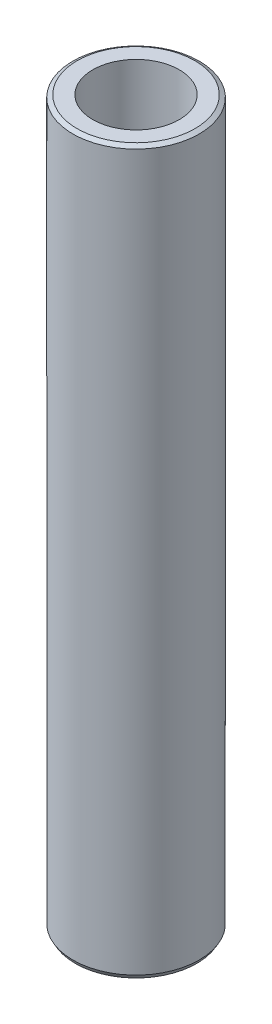
ISO-10303-21;
HEADER;
FILE_DESCRIPTION(('STEP AP214'),'2;1');
FILE_NAME('part.step','',(''),(''),'','','');
FILE_SCHEMA(('AUTOMOTIVE_DESIGN { 1 0 10303 214 1 1 1 1 }'));
ENDSEC;
DATA;
#1=APPLICATION_CONTEXT('core data for automotive mechanical design processes');
#2=APPLICATION_PROTOCOL_DEFINITION('international standard','automotive_design',2000,#1);
#3=PRODUCT_CONTEXT('',#1,'mechanical');
#4=PRODUCT('Part','Part','',(#3));
#5=PRODUCT_RELATED_PRODUCT_CATEGORY('part','',(#4));
#6=PRODUCT_DEFINITION_FORMATION('','',#4);
#7=PRODUCT_DEFINITION_CONTEXT('part definition',#1,'design');
#8=PRODUCT_DEFINITION('design','',#6,#7);
#9=PRODUCT_DEFINITION_SHAPE('','',#8);
#10=(LENGTH_UNIT() NAMED_UNIT(*) SI_UNIT(.MILLI.,.METRE.));
#11=(NAMED_UNIT(*) PLANE_ANGLE_UNIT() SI_UNIT($,.RADIAN.));
#12=(NAMED_UNIT(*) SI_UNIT($,.STERADIAN.) SOLID_ANGLE_UNIT());
#13=UNCERTAINTY_MEASURE_WITH_UNIT(LENGTH_MEASURE(1.E-05),#10,'distance_accuracy_value','');
#14=(GEOMETRIC_REPRESENTATION_CONTEXT(3) GLOBAL_UNCERTAINTY_ASSIGNED_CONTEXT((#13)) GLOBAL_UNIT_ASSIGNED_CONTEXT((#10,
#11,#12)) REPRESENTATION_CONTEXT('',''));
#15=CARTESIAN_POINT('',(0.,0.,0.));
#16=DIRECTION('',(0.,0.,1.));
#17=DIRECTION('',(1.,0.,0.));
#18=AXIS2_PLACEMENT_3D('',#15,#16,#17);
#19=CARTESIAN_POINT('',(0.,600.,0.));
#20=DIRECTION('',(0.,-1.,0.));
#21=DIRECTION('',(0.,0.,-1.));
#22=AXIS2_PLACEMENT_3D('',#19,#20,#21);
#23=CYLINDRICAL_SURFACE('',#22,52.5);
#24=CARTESIAN_POINT('',(0.,597.94748505042,0.));
#25=DIRECTION('',(0.,1.,0.));
#26=DIRECTION('',(0.,0.,1.));
#27=AXIS2_PLACEMENT_3D('',#24,#25,#26);
#28=CIRCLE('',#27,52.5);
#29=CARTESIAN_POINT('',(0.,597.94748505042,-52.5000000000001));
#30=VERTEX_POINT('',#29);
#31=EDGE_CURVE('E50',#30,#30,#28,.F.);
#32=ORIENTED_EDGE('',*,*,#31,.T.);
#33=EDGE_LOOP('',(#32));
#34=FACE_BOUND('',#33,.T.);
#35=CARTESIAN_POINT('',(0.,3.55506017596718,0.));
#36=DIRECTION('',(0.,1.,0.));
#37=DIRECTION('',(0.,0.,1.));
#38=AXIS2_PLACEMENT_3D('',#35,#36,#37);
#39=CIRCLE('',#38,52.5);
#40=CARTESIAN_POINT('',(0.,3.55506017596718,52.5));
#41=VERTEX_POINT('',#40);
#42=EDGE_CURVE('E51',#41,#41,#39,.T.);
#43=ORIENTED_EDGE('',*,*,#42,.T.);
#44=EDGE_LOOP('',(#43));
#45=FACE_BOUND('',#44,.T.);
#46=ADVANCED_FACE('F39',(#34,#45),#23,.T.);
#47=CARTESIAN_POINT('',(0.,600.,0.));
#48=DIRECTION('',(0.,1.,0.));
#49=DIRECTION('',(0.,0.,1.));
#50=AXIS2_PLACEMENT_3D('',#47,#48,#49);
#51=PLANE('',#50);
#52=CARTESIAN_POINT('',(0.,600.,0.));
#53=DIRECTION('',(0.,1.,0.));
#54=DIRECTION('',(0.,0.,1.));
#55=AXIS2_PLACEMENT_3D('',#52,#53,#54);
#56=CIRCLE('',#55,48.9449398240332);
#57=CARTESIAN_POINT('',(0.,600.,-48.9449398240333));
#58=VERTEX_POINT('',#57);
#59=EDGE_CURVE('E54',#58,#58,#56,.T.);
#60=ORIENTED_EDGE('',*,*,#59,.T.);
#61=EDGE_LOOP('',(#60));
#62=FACE_BOUND('',#61,.T.);
#63=CARTESIAN_POINT('',(0.,600.,0.));
#64=DIRECTION('',(0.,1.,0.));
#65=DIRECTION('',(0.,0.,1.));
#66=AXIS2_PLACEMENT_3D('',#63,#64,#65);
#67=CIRCLE('',#66,35.9283273639722);
#68=CARTESIAN_POINT('',(0.,600.,35.9283273639722));
#69=VERTEX_POINT('',#68);
#70=EDGE_CURVE('E58',#69,#69,#67,.T.);
#71=ORIENTED_EDGE('',*,*,#70,.F.);
#72=EDGE_LOOP('',(#71));
#73=FACE_BOUND('',#72,.T.);
#74=ADVANCED_FACE('F69',(#62,#73),#51,.T.);
#75=CARTESIAN_POINT('',(0.,0.,0.));
#76=DIRECTION('',(0.,1.,0.));
#77=DIRECTION('',(0.,0.,1.));
#78=AXIS2_PLACEMENT_3D('',#75,#76,#77);
#79=PLANE('',#78);
#80=CARTESIAN_POINT('',(0.,0.,0.));
#81=DIRECTION('',(0.,1.,0.));
#82=DIRECTION('',(0.,0.,1.));
#83=AXIS2_PLACEMENT_3D('',#80,#81,#82);
#84=CIRCLE('',#83,50.44748505042);
#85=CARTESIAN_POINT('',(0.,0.,50.44748505042));
#86=VERTEX_POINT('',#85);
#87=EDGE_CURVE('E10',#86,#86,#84,.F.);
#88=ORIENTED_EDGE('',*,*,#87,.T.);
#89=EDGE_LOOP('',(#88));
#90=FACE_BOUND('',#89,.T.);
#91=CARTESIAN_POINT('',(0.,0.,0.));
#92=DIRECTION('',(0.,1.,0.));
#93=DIRECTION('',(0.,0.,1.));
#94=AXIS2_PLACEMENT_3D('',#91,#92,#93);
#95=CIRCLE('',#94,35.9283273639722);
#96=CARTESIAN_POINT('',(0.,0.,35.9283273639722));
#97=VERTEX_POINT('',#96);
#98=EDGE_CURVE('E63',#97,#97,#95,.T.);
#99=ORIENTED_EDGE('',*,*,#98,.T.);
#100=EDGE_LOOP('',(#99));
#101=FACE_BOUND('',#100,.T.);
#102=ADVANCED_FACE('F75',(#90,#101),#79,.F.);
#103=CARTESIAN_POINT('',(0.,600.,0.));
#104=DIRECTION('',(0.,-1.,0.));
#105=DIRECTION('',(0.,0.,-1.));
#106=AXIS2_PLACEMENT_3D('',#103,#104,#105);
#107=CYLINDRICAL_SURFACE('',#106,35.9283273639722);
#108=ORIENTED_EDGE('',*,*,#70,.T.);
#109=EDGE_LOOP('',(#108));
#110=FACE_BOUND('',#109,.T.);
#111=ORIENTED_EDGE('',*,*,#98,.F.);
#112=EDGE_LOOP('',(#111));
#113=FACE_BOUND('',#112,.T.);
#114=ADVANCED_FACE('F70',(#110,#113),#107,.F.);
#115=CARTESIAN_POINT('',(0.,600.,0.));
#116=DIRECTION('',(0.,-1.,0.));
#117=DIRECTION('',(0.,0.,-1.));
#118=AXIS2_PLACEMENT_3D('',#115,#116,#117);
#119=CONICAL_SURFACE('',#118,48.9449398240332,1.04719755119658);
#120=CARTESIAN_POINT('',(0.,597.94748505042,-52.5000000000001));
#121=CARTESIAN_POINT('',(0.,597.968865414478,-52.4629681231671));
#122=CARTESIAN_POINT('',(0.,597.990245778536,-52.4259362463341));
#123=CARTESIAN_POINT('',(0.,598.033006506653,-52.3518724926682));
#124=CARTESIAN_POINT('',(0.,598.054386870711,-52.3148406158352));
#125=CARTESIAN_POINT('',(0.,598.097147598827,-52.2407768621692));
#126=CARTESIAN_POINT('',(0.,598.118527962885,-52.2037449853362));
#127=CARTESIAN_POINT('',(0.,598.161288691001,-52.1296812316702));
#128=CARTESIAN_POINT('',(0.,598.182669055059,-52.0926493548372));
#129=CARTESIAN_POINT('',(0.,598.225429783176,-52.0185856011713));
#130=CARTESIAN_POINT('',(0.,598.246810147234,-51.9815537243383));
#131=CARTESIAN_POINT('',(0.,598.28957087535,-51.9074899706723));
#132=CARTESIAN_POINT('',(0.,598.310951239408,-51.8704580938393));
#133=CARTESIAN_POINT('',(0.,598.353711967524,-51.7963943401733));
#134=CARTESIAN_POINT('',(0.,598.375092331583,-51.7593624633403));
#135=CARTESIAN_POINT('',(0.,598.417853059699,-51.6852987096744));
#136=CARTESIAN_POINT('',(0.,598.439233423757,-51.6482668328414));
#137=CARTESIAN_POINT('',(0.,598.481994151873,-51.5742030791754));
#138=CARTESIAN_POINT('',(0.,598.503374515931,-51.5371712023424));
#139=CARTESIAN_POINT('',(0.,598.546135244047,-51.4631074486765));
#140=CARTESIAN_POINT('',(0.,598.567515608106,-51.4260755718435));
#141=CARTESIAN_POINT('',(0.,598.610276336222,-51.3520118181775));
#142=CARTESIAN_POINT('',(0.,598.63165670028,-51.3149799413445));
#143=CARTESIAN_POINT('',(0.,598.674417428396,-51.2409161876785));
#144=CARTESIAN_POINT('',(0.,598.695797792454,-51.2038843108456));
#145=CARTESIAN_POINT('',(0.,598.738558520571,-51.1298205571796));
#146=CARTESIAN_POINT('',(0.,598.759938884629,-51.0927886803466));
#147=CARTESIAN_POINT('',(0.,598.802699612745,-51.0187249266806));
#148=CARTESIAN_POINT('',(0.,598.824079976803,-50.9816930498476));
#149=CARTESIAN_POINT('',(0.,598.866840704919,-50.9076292961817));
#150=CARTESIAN_POINT('',(0.,598.888221068978,-50.8705974193487));
#151=CARTESIAN_POINT('',(0.,598.930981797094,-50.7965336656827));
#152=CARTESIAN_POINT('',(0.,598.952362161152,-50.7595017888497));
#153=CARTESIAN_POINT('',(0.,598.995122889268,-50.6854380351837));
#154=CARTESIAN_POINT('',(0.,599.016503253326,-50.6484061583508));
#155=CARTESIAN_POINT('',(0.,599.059263981443,-50.5743424046848));
#156=CARTESIAN_POINT('',(0.,599.080644345501,-50.5373105278518));
#157=CARTESIAN_POINT('',(0.,599.123405073617,-50.4632467741858));
#158=CARTESIAN_POINT('',(0.,599.144785437675,-50.4262148973528));
#159=CARTESIAN_POINT('',(0.,599.187546165791,-50.3521511436868));
#160=CARTESIAN_POINT('',(0.,599.208926529849,-50.3151192668539));
#161=CARTESIAN_POINT('',(0.,599.251687257966,-50.2410555131879));
#162=CARTESIAN_POINT('',(0.,599.273067622024,-50.2040236363549));
#163=CARTESIAN_POINT('',(0.,599.31582835014,-50.1299598826889));
#164=CARTESIAN_POINT('',(0.,599.337208714198,-50.0929280058559));
#165=CARTESIAN_POINT('',(0.,599.379969442314,-50.01886425219));
#166=CARTESIAN_POINT('',(0.,599.401349806373,-49.981832375357));
#167=CARTESIAN_POINT('',(0.,599.444110534489,-49.907768621691));
#168=CARTESIAN_POINT('',(0.,599.465490898547,-49.870736744858));
#169=CARTESIAN_POINT('',(0.,599.508251626663,-49.7966729911921));
#170=CARTESIAN_POINT('',(0.,599.529631990721,-49.7596411143591));
#171=CARTESIAN_POINT('',(0.,599.572392718837,-49.6855773606931));
#172=CARTESIAN_POINT('',(0.,599.593773082896,-49.6485454838601));
#173=CARTESIAN_POINT('',(0.,599.636533811012,-49.5744817301941));
#174=CARTESIAN_POINT('',(0.,599.65791417507,-49.5374498533611));
#175=CARTESIAN_POINT('',(0.,599.700674903186,-49.4633860996952));
#176=CARTESIAN_POINT('',(0.,599.722055267244,-49.4263542228622));
#177=CARTESIAN_POINT('',(0.,599.764815995361,-49.3522904691962));
#178=CARTESIAN_POINT('',(0.,599.786196359419,-49.3152585923632));
#179=CARTESIAN_POINT('',(0.,599.828957087535,-49.2411948386972));
#180=CARTESIAN_POINT('',(0.,599.850337451593,-49.2041629618643));
#181=CARTESIAN_POINT('',(0.,599.893098179709,-49.1300992081983));
#182=CARTESIAN_POINT('',(0.,599.914478543767,-49.0930673313653));
#183=CARTESIAN_POINT('',(0.,599.957239271884,-49.0190035776993));
#184=CARTESIAN_POINT('',(0.,599.978619635942,-48.9819717008663));
#185=CARTESIAN_POINT('',(0.,600.,-48.9449398240333));
#186=B_SPLINE_CURVE_WITH_KNOTS('',3,(#120,#121,#122,#123,#124,#125,#126,#127,#128,#129,#130,
#131,#132,#133,#134,#135,#136,#137,#138,#139,#140,#141,#142,#143,#144,#145,#146,#147,#148,#149,
#150,#151,#152,#153,#154,#155,#156,#157,#158,#159,#160,#161,#162,#163,#164,#165,#166,#167,#168,
#169,#170,#171,#172,#173,#174,#175,#176,#177,#178,#179,#180,#181,#182,#183,#184,#185),
.UNSPECIFIED.,.F.,.F.,(4,2,2,2,2,2,2,2,2,2,2,2,2,2,2,2,2,2,2,2,2,2,2,2,2,2,2,2,2,2,2,2,4),(0.,
0.128282184348723,0.25656436869744,0.384846553046162,0.513128737394935,0.641410921743658,
0.769693106092374,0.897975290441097,1.02625747478987,1.15453965913859,1.28282184348731,
1.41110402783603,1.53938621218481,1.66766839653353,1.79595058088225,1.92423276523097,
2.05251494957975,2.18079713392846,2.30907931827718,2.4373615026259,2.56564368697468,
2.6939258713234,2.82220805567212,2.95049024002084,3.07877242436961,3.20705460871833,
3.33533679306705,3.46361897741577,3.59190116176455,3.72018334611327,3.84846553046199,
3.97674771481071,4.10502989915948),.UNSPECIFIED.);
#187=EDGE_CURVE('BSEAM81',#30,#58,#186,.T.);
#188=ORIENTED_EDGE('',*,*,#31,.F.);
#189=ORIENTED_EDGE('',*,*,#59,.F.);
#190=ORIENTED_EDGE('',*,*,#187,.T.);
#191=ORIENTED_EDGE('',*,*,#187,.F.);
#192=EDGE_LOOP('',(#188,#190,#189,#191));
#193=FACE_BOUND('',#192,.T.);
#194=ADVANCED_FACE('F81',(#193),#119,.T.);
#195=CARTESIAN_POINT('',(0.,3.55506017596718,0.));
#196=DIRECTION('',(0.,1.,0.));
#197=DIRECTION('',(0.,0.,1.));
#198=AXIS2_PLACEMENT_3D('',#195,#196,#197);
#199=CONICAL_SURFACE('',#198,52.5,0.523598775598301);
#200=ORIENTED_EDGE('',*,*,#87,.F.);
#201=EDGE_LOOP('',(#200));
#202=FACE_BOUND('',#201,.T.);
#203=ORIENTED_EDGE('',*,*,#42,.F.);
#204=EDGE_LOOP('',(#203));
#205=FACE_BOUND('',#204,.T.);
#206=ADVANCED_FACE('F45',(#202,#205),#199,.T.);
#207=CLOSED_SHELL('',(#46,#74,#102,#114,#194,#206));
#208=MANIFOLD_SOLID_BREP('B2',#207);
#209=ADVANCED_BREP_SHAPE_REPRESENTATION('',(#18,#208),#14);
#210=SHAPE_DEFINITION_REPRESENTATION(#9,#209);
ENDSEC;
END-ISO-10303-21;
